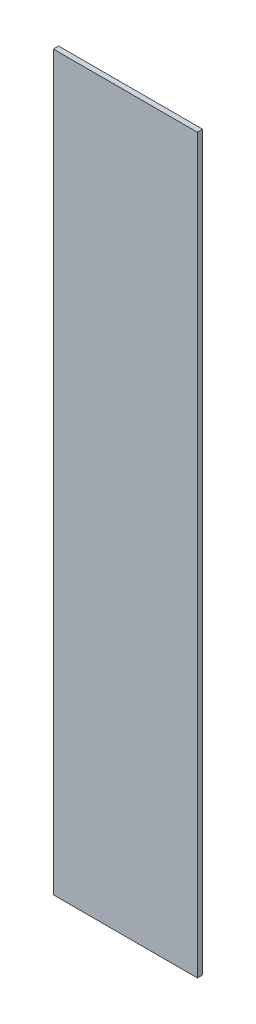
ISO-10303-21;
HEADER;
FILE_DESCRIPTION(('STEP AP214'),'2;1');
FILE_NAME('part.step','',(''),(''),'','','');
FILE_SCHEMA(('AUTOMOTIVE_DESIGN { 1 0 10303 214 1 1 1 1 }'));
ENDSEC;
DATA;
#1=APPLICATION_CONTEXT('core data for automotive mechanical design processes');
#2=APPLICATION_PROTOCOL_DEFINITION('international standard','automotive_design',2000,#1);
#3=PRODUCT_CONTEXT('',#1,'mechanical');
#4=PRODUCT('Part','Part','',(#3));
#5=PRODUCT_RELATED_PRODUCT_CATEGORY('part','',(#4));
#6=PRODUCT_DEFINITION_FORMATION('','',#4);
#7=PRODUCT_DEFINITION_CONTEXT('part definition',#1,'design');
#8=PRODUCT_DEFINITION('design','',#6,#7);
#9=PRODUCT_DEFINITION_SHAPE('','',#8);
#10=(LENGTH_UNIT() NAMED_UNIT(*) SI_UNIT(.MILLI.,.METRE.));
#11=(NAMED_UNIT(*) PLANE_ANGLE_UNIT() SI_UNIT($,.RADIAN.));
#12=(NAMED_UNIT(*) SI_UNIT($,.STERADIAN.) SOLID_ANGLE_UNIT());
#13=UNCERTAINTY_MEASURE_WITH_UNIT(LENGTH_MEASURE(1.E-05),#10,'distance_accuracy_value','');
#14=(GEOMETRIC_REPRESENTATION_CONTEXT(3) GLOBAL_UNCERTAINTY_ASSIGNED_CONTEXT((#13)) GLOBAL_UNIT_ASSIGNED_CONTEXT((#10,
#11,#12)) REPRESENTATION_CONTEXT('',''));
#15=CARTESIAN_POINT('',(0.,0.,0.));
#16=DIRECTION('',(0.,0.,1.));
#17=DIRECTION('',(1.,0.,0.));
#18=AXIS2_PLACEMENT_3D('',#15,#16,#17);
#19=CARTESIAN_POINT('',(0.,0.,11.1125));
#20=DIRECTION('',(1.,0.,0.));
#21=DIRECTION('',(0.,0.,-1.));
#22=AXIS2_PLACEMENT_3D('',#19,#20,#21);
#23=PLANE('',#22);
#24=DIRECTION('',(0.,-1.,0.));
#25=VECTOR('',#24,1.);
#26=CARTESIAN_POINT('',(0.,0.,0.));
#27=LINE('',#26,#25);
#28=CARTESIAN_POINT('',(0.,1549.4,0.));
#29=VERTEX_POINT('',#28);
#30=CARTESIAN_POINT('',(0.,0.,0.));
#31=VERTEX_POINT('',#30);
#32=EDGE_CURVE('E96',#29,#31,#27,.T.);
#33=ORIENTED_EDGE('',*,*,#32,.T.);
#34=DIRECTION('',(0.,0.,-1.));
#35=VECTOR('',#34,1.);
#36=CARTESIAN_POINT('',(0.,0.,11.1125));
#37=LINE('',#36,#35);
#38=CARTESIAN_POINT('',(0.,0.,11.1125));
#39=VERTEX_POINT('',#38);
#40=EDGE_CURVE('E11',#39,#31,#37,.T.);
#41=ORIENTED_EDGE('',*,*,#40,.F.);
#42=DIRECTION('',(0.,-1.,0.));
#43=VECTOR('',#42,1.);
#44=CARTESIAN_POINT('',(0.,0.,11.1125));
#45=LINE('',#44,#43);
#46=CARTESIAN_POINT('',(0.,1549.4,11.1125));
#47=VERTEX_POINT('',#46);
#48=EDGE_CURVE('E84',#47,#39,#45,.T.);
#49=ORIENTED_EDGE('',*,*,#48,.F.);
#50=DIRECTION('',(0.,0.,-1.));
#51=VECTOR('',#50,1.);
#52=CARTESIAN_POINT('',(0.,1549.4,11.1125));
#53=LINE('',#52,#51);
#54=EDGE_CURVE('E92',#47,#29,#53,.T.);
#55=ORIENTED_EDGE('',*,*,#54,.T.);
#56=EDGE_LOOP('',(#33,#41,#49,#55));
#57=FACE_BOUND('',#56,.T.);
#58=ADVANCED_FACE('F33',(#57),#23,.F.);
#59=CARTESIAN_POINT('',(0.,0.,11.1125));
#60=DIRECTION('',(0.,1.,0.));
#61=DIRECTION('',(0.,0.,1.));
#62=AXIS2_PLACEMENT_3D('',#59,#60,#61);
#63=PLANE('',#62);
#64=DIRECTION('',(1.,0.,0.));
#65=VECTOR('',#64,1.);
#66=CARTESIAN_POINT('',(0.,0.,0.));
#67=LINE('',#66,#65);
#68=CARTESIAN_POINT('',(304.8,0.,0.));
#69=VERTEX_POINT('',#68);
#70=EDGE_CURVE('E88',#31,#69,#67,.T.);
#71=ORIENTED_EDGE('',*,*,#70,.T.);
#72=DIRECTION('',(0.,0.,-1.));
#73=VECTOR('',#72,1.);
#74=CARTESIAN_POINT('',(304.8,0.,11.1125));
#75=LINE('',#74,#73);
#76=CARTESIAN_POINT('',(304.8,0.,11.1125));
#77=VERTEX_POINT('',#76);
#78=EDGE_CURVE('E41',#77,#69,#75,.T.);
#79=ORIENTED_EDGE('',*,*,#78,.F.);
#80=DIRECTION('',(1.,0.,0.));
#81=VECTOR('',#80,1.);
#82=CARTESIAN_POINT('',(0.,0.,11.1125));
#83=LINE('',#82,#81);
#84=EDGE_CURVE('E79',#39,#77,#83,.T.);
#85=ORIENTED_EDGE('',*,*,#84,.F.);
#86=ORIENTED_EDGE('',*,*,#40,.T.);
#87=EDGE_LOOP('',(#71,#79,#85,#86));
#88=FACE_BOUND('',#87,.T.);
#89=ADVANCED_FACE('F87',(#88),#63,.F.);
#90=CARTESIAN_POINT('',(304.8,0.,11.1125));
#91=DIRECTION('',(-1.,0.,0.));
#92=DIRECTION('',(0.,0.,1.));
#93=AXIS2_PLACEMENT_3D('',#90,#91,#92);
#94=PLANE('',#93);
#95=DIRECTION('',(0.,1.,0.));
#96=VECTOR('',#95,1.);
#97=CARTESIAN_POINT('',(304.8,0.,0.));
#98=LINE('',#97,#96);
#99=CARTESIAN_POINT('',(304.8,1549.4,0.));
#100=VERTEX_POINT('',#99);
#101=EDGE_CURVE('E66',#69,#100,#98,.T.);
#102=ORIENTED_EDGE('',*,*,#101,.T.);
#103=DIRECTION('',(0.,0.,-1.));
#104=VECTOR('',#103,1.);
#105=CARTESIAN_POINT('',(304.8,1549.4,11.1125));
#106=LINE('',#105,#104);
#107=CARTESIAN_POINT('',(304.8,1549.4,11.1125));
#108=VERTEX_POINT('',#107);
#109=EDGE_CURVE('E89',#108,#100,#106,.T.);
#110=ORIENTED_EDGE('',*,*,#109,.F.);
#111=DIRECTION('',(0.,1.,0.));
#112=VECTOR('',#111,1.);
#113=CARTESIAN_POINT('',(304.8,0.,11.1125));
#114=LINE('',#113,#112);
#115=EDGE_CURVE('E82',#77,#108,#114,.T.);
#116=ORIENTED_EDGE('',*,*,#115,.F.);
#117=ORIENTED_EDGE('',*,*,#78,.T.);
#118=EDGE_LOOP('',(#102,#110,#116,#117));
#119=FACE_BOUND('',#118,.T.);
#120=ADVANCED_FACE('F90',(#119),#94,.F.);
#121=CARTESIAN_POINT('',(0.,1549.4,11.1125));
#122=DIRECTION('',(0.,-1.,0.));
#123=DIRECTION('',(0.,0.,-1.));
#124=AXIS2_PLACEMENT_3D('',#121,#122,#123);
#125=PLANE('',#124);
#126=DIRECTION('',(-1.,0.,0.));
#127=VECTOR('',#126,1.);
#128=CARTESIAN_POINT('',(0.,1549.4,0.));
#129=LINE('',#128,#127);
#130=EDGE_CURVE('E72',#100,#29,#129,.T.);
#131=ORIENTED_EDGE('',*,*,#130,.T.);
#132=ORIENTED_EDGE('',*,*,#54,.F.);
#133=DIRECTION('',(-1.,0.,0.));
#134=VECTOR('',#133,1.);
#135=CARTESIAN_POINT('',(0.,1549.4,11.1125));
#136=LINE('',#135,#134);
#137=EDGE_CURVE('E49',#108,#47,#136,.T.);
#138=ORIENTED_EDGE('',*,*,#137,.F.);
#139=ORIENTED_EDGE('',*,*,#109,.T.);
#140=EDGE_LOOP('',(#131,#132,#138,#139));
#141=FACE_BOUND('',#140,.T.);
#142=ADVANCED_FACE('F103',(#141),#125,.F.);
#143=CARTESIAN_POINT('',(0.,0.,11.1125));
#144=DIRECTION('',(0.,0.,-1.));
#145=DIRECTION('',(-1.,0.,0.));
#146=AXIS2_PLACEMENT_3D('',#143,#144,#145);
#147=PLANE('',#146);
#148=ORIENTED_EDGE('',*,*,#48,.T.);
#149=ORIENTED_EDGE('',*,*,#84,.T.);
#150=ORIENTED_EDGE('',*,*,#115,.T.);
#151=ORIENTED_EDGE('',*,*,#137,.T.);
#152=EDGE_LOOP('',(#148,#149,#150,#151));
#153=FACE_BOUND('',#152,.T.);
#154=ADVANCED_FACE('F80',(#153),#147,.F.);
#155=CARTESIAN_POINT('',(0.,0.,0.));
#156=DIRECTION('',(0.,0.,-1.));
#157=DIRECTION('',(-1.,0.,0.));
#158=AXIS2_PLACEMENT_3D('',#155,#156,#157);
#159=PLANE('',#158);
#160=ORIENTED_EDGE('',*,*,#32,.F.);
#161=ORIENTED_EDGE('',*,*,#130,.F.);
#162=ORIENTED_EDGE('',*,*,#101,.F.);
#163=ORIENTED_EDGE('',*,*,#70,.F.);
#164=EDGE_LOOP('',(#160,#161,#162,#163));
#165=FACE_BOUND('',#164,.T.);
#166=ADVANCED_FACE('F106',(#165),#159,.T.);
#167=CLOSED_SHELL('',(#58,#89,#120,#142,#154,#166));
#168=MANIFOLD_SOLID_BREP('B2',#167);
#169=ADVANCED_BREP_SHAPE_REPRESENTATION('',(#18,#168),#14);
#170=SHAPE_DEFINITION_REPRESENTATION(#9,#169);
ENDSEC;
END-ISO-10303-21;
